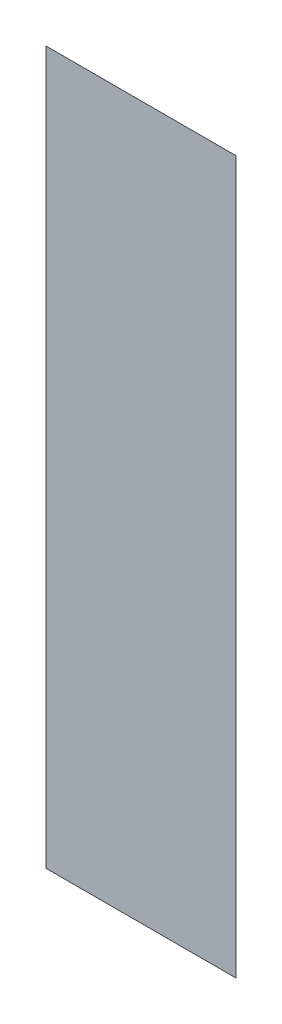
ISO-10303-21;
HEADER;
FILE_DESCRIPTION(('STEP AP214'),'2;1');
FILE_NAME('part.step','',(''),(''),'','','');
FILE_SCHEMA(('AUTOMOTIVE_DESIGN { 1 0 10303 214 1 1 1 1 }'));
ENDSEC;
DATA;
#1=APPLICATION_CONTEXT('core data for automotive mechanical design processes');
#2=APPLICATION_PROTOCOL_DEFINITION('international standard','automotive_design',2000,#1);
#3=PRODUCT_CONTEXT('',#1,'mechanical');
#4=PRODUCT('Part','Part','',(#3));
#5=PRODUCT_RELATED_PRODUCT_CATEGORY('part','',(#4));
#6=PRODUCT_DEFINITION_FORMATION('','',#4);
#7=PRODUCT_DEFINITION_CONTEXT('part definition',#1,'design');
#8=PRODUCT_DEFINITION('design','',#6,#7);
#9=PRODUCT_DEFINITION_SHAPE('','',#8);
#10=(LENGTH_UNIT() NAMED_UNIT(*) SI_UNIT(.MILLI.,.METRE.));
#11=(NAMED_UNIT(*) PLANE_ANGLE_UNIT() SI_UNIT($,.RADIAN.));
#12=(NAMED_UNIT(*) SI_UNIT($,.STERADIAN.) SOLID_ANGLE_UNIT());
#13=UNCERTAINTY_MEASURE_WITH_UNIT(LENGTH_MEASURE(1.E-05),#10,'distance_accuracy_value','');
#14=(GEOMETRIC_REPRESENTATION_CONTEXT(3) GLOBAL_UNCERTAINTY_ASSIGNED_CONTEXT((#13)) GLOBAL_UNIT_ASSIGNED_CONTEXT((#10,
#11,#12)) REPRESENTATION_CONTEXT('',''));
#15=CARTESIAN_POINT('',(0.,0.,0.));
#16=DIRECTION('',(0.,0.,1.));
#17=DIRECTION('',(1.,0.,0.));
#18=AXIS2_PLACEMENT_3D('',#15,#16,#17);
#19=CARTESIAN_POINT('',(-0.526839360236785,-0.608027916130796,0.0889425196850394));
#20=DIRECTION('',(0.,0.,1.));
#21=DIRECTION('',(0.,-1.,0.));
#22=AXIS2_PLACEMENT_3D('',#19,#20,#21);
#23=PLANE('',#22);
#24=CARTESIAN_POINT('',(-0.537422037402139,-0.609917679910324,0.0889425196850394));
#25=DIRECTION('',(1.,0.,0.));
#26=VECTOR('',#25,1.);
#27=LINE('',#24,#26);
#28=CARTESIAN_POINT('',(-0.537422037402139,-0.609917679910324,0.0890685039370079));
#29=VERTEX_POINT('',#28);
#30=CARTESIAN_POINT('',(-0.527343297244659,-0.609917679910324,0.0890685039370079));
#31=VERTEX_POINT('',#30);
#32=EDGE_CURVE('E50',#29,#31,#27,.T.);
#33=ORIENTED_EDGE('',*,*,#32,.T.);
#34=CARTESIAN_POINT('',(-0.527343297244659,-0.609917679910324,0.0889425196850394));
#35=DIRECTION('',(0.,-1.,0.));
#36=VECTOR('',#35,1.);
#37=LINE('',#34,#36);
#38=CARTESIAN_POINT('',(-0.527343297244659,-0.647712955500875,0.0890685039370079));
#39=VERTEX_POINT('',#38);
#40=EDGE_CURVE('E28',#31,#39,#37,.T.);
#41=ORIENTED_EDGE('',*,*,#40,.T.);
#42=CARTESIAN_POINT('',(-0.527343297244659,-0.647712955500875,0.0889425196850394));
#43=DIRECTION('',(-1.,0.,0.));
#44=VECTOR('',#43,1.);
#45=LINE('',#42,#44);
#46=CARTESIAN_POINT('',(-0.537422037402139,-0.647712955500875,0.0890685039370079));
#47=VERTEX_POINT('',#46);
#48=EDGE_CURVE('E11',#39,#47,#45,.T.);
#49=ORIENTED_EDGE('',*,*,#48,.T.);
#50=CARTESIAN_POINT('',(-0.537422037402139,-0.647712955500875,0.0889425196850394));
#51=DIRECTION('',(0.,1.,0.));
#52=VECTOR('',#51,1.);
#53=LINE('',#50,#52);
#54=EDGE_CURVE('E41',#47,#29,#53,.T.);
#55=ORIENTED_EDGE('',*,*,#54,.T.);
#56=EDGE_LOOP('',(#33,#41,#49,#55));
#57=FACE_BOUND('',#56,.T.);
#58=ADVANCED_FACE('F17',(#57),#23,.F.);
#59=CARTESIAN_POINT('',(-0.526839360236785,-0.608027916130796,0.0891944881889764));
#60=DIRECTION('',(0.,0.,1.));
#61=DIRECTION('',(0.,-1.,0.));
#62=AXIS2_PLACEMENT_3D('',#59,#60,#61);
#63=PLANE('',#62);
#64=ORIENTED_EDGE('',*,*,#40,.F.);
#65=ORIENTED_EDGE('',*,*,#32,.F.);
#66=ORIENTED_EDGE('',*,*,#54,.F.);
#67=ORIENTED_EDGE('',*,*,#48,.F.);
#68=EDGE_LOOP('',(#64,#65,#66,#67));
#69=FACE_BOUND('',#68,.T.);
#70=ADVANCED_FACE('F49',(#69),#63,.T.);
#71=CLOSED_SHELL('',(#58,#70));
#72=MANIFOLD_SOLID_BREP('B1',#71);
#73=ADVANCED_BREP_SHAPE_REPRESENTATION('',(#18,#72),#14);
#74=SHAPE_DEFINITION_REPRESENTATION(#9,#73);
ENDSEC;
END-ISO-10303-21;
